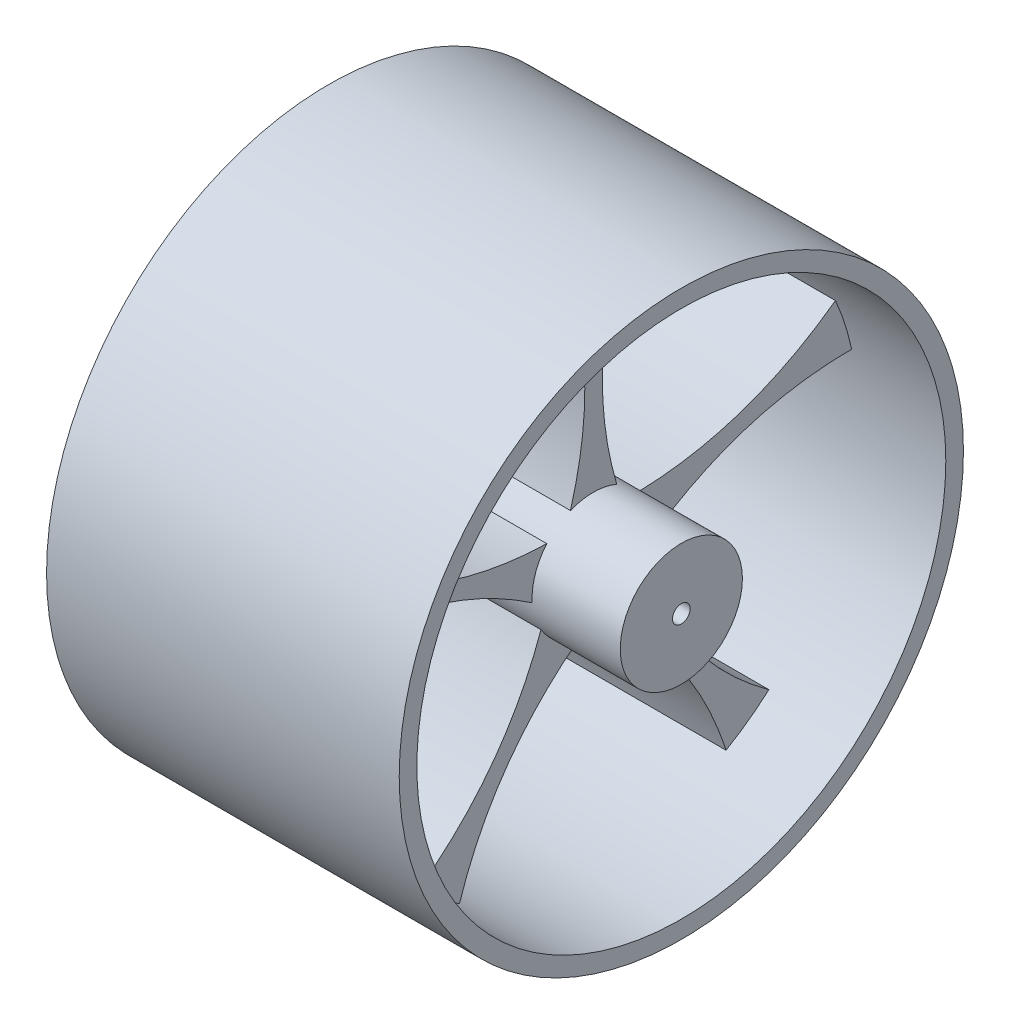
ISO-10303-21;
HEADER;
FILE_DESCRIPTION(('STEP AP214'),'2;1');
FILE_NAME('part.step','',(''),(''),'','','');
FILE_SCHEMA(('AUTOMOTIVE_DESIGN { 1 0 10303 214 1 1 1 1 }'));
ENDSEC;
DATA;
#1=APPLICATION_CONTEXT('core data for automotive mechanical design processes');
#2=APPLICATION_PROTOCOL_DEFINITION('international standard','automotive_design',2000,#1);
#3=PRODUCT_CONTEXT('',#1,'mechanical');
#4=PRODUCT('Part','Part','',(#3));
#5=PRODUCT_RELATED_PRODUCT_CATEGORY('part','',(#4));
#6=PRODUCT_DEFINITION_FORMATION('','',#4);
#7=PRODUCT_DEFINITION_CONTEXT('part definition',#1,'design');
#8=PRODUCT_DEFINITION('design','',#6,#7);
#9=PRODUCT_DEFINITION_SHAPE('','',#8);
#10=(LENGTH_UNIT() NAMED_UNIT(*) SI_UNIT(.MILLI.,.METRE.));
#11=(NAMED_UNIT(*) PLANE_ANGLE_UNIT() SI_UNIT($,.RADIAN.));
#12=(NAMED_UNIT(*) SI_UNIT($,.STERADIAN.) SOLID_ANGLE_UNIT());
#13=UNCERTAINTY_MEASURE_WITH_UNIT(LENGTH_MEASURE(1.E-05),#10,'distance_accuracy_value','');
#14=(GEOMETRIC_REPRESENTATION_CONTEXT(3) GLOBAL_UNCERTAINTY_ASSIGNED_CONTEXT((#13)) GLOBAL_UNIT_ASSIGNED_CONTEXT((#10,
#11,#12)) REPRESENTATION_CONTEXT('',''));
#15=CARTESIAN_POINT('',(0.,0.,0.));
#16=DIRECTION('',(0.,0.,1.));
#17=DIRECTION('',(1.,0.,0.));
#18=AXIS2_PLACEMENT_3D('',#15,#16,#17);
#19=CARTESIAN_POINT('',(100.,0.,0.));
#20=DIRECTION('',(-1.,0.,0.));
#21=DIRECTION('',(0.,0.,1.));
#22=AXIS2_PLACEMENT_3D('',#19,#20,#21);
#23=CYLINDRICAL_SURFACE('',#22,75.);
#24=CARTESIAN_POINT('',(100.,0.,0.));
#25=DIRECTION('',(1.,0.,0.));
#26=DIRECTION('',(0.,0.,-1.));
#27=AXIS2_PLACEMENT_3D('',#24,#25,#26);
#28=CIRCLE('',#27,75.);
#29=CARTESIAN_POINT('',(100.,0.,-75.));
#30=VERTEX_POINT('',#29);
#31=EDGE_CURVE('E131',#30,#30,#28,.T.);
#32=ORIENTED_EDGE('',*,*,#31,.T.);
#33=EDGE_LOOP('',(#32));
#34=FACE_BOUND('',#33,.T.);
#35=CARTESIAN_POINT('',(0.,0.,0.));
#36=DIRECTION('',(1.,0.,0.));
#37=DIRECTION('',(0.,0.,-1.));
#38=AXIS2_PLACEMENT_3D('',#35,#36,#37);
#39=CIRCLE('',#38,75.);
#40=CARTESIAN_POINT('',(0.,0.,-75.));
#41=VERTEX_POINT('',#40);
#42=EDGE_CURVE('E540',#41,#41,#39,.T.);
#43=ORIENTED_EDGE('',*,*,#42,.F.);
#44=EDGE_LOOP('',(#43));
#45=FACE_BOUND('',#44,.T.);
#46=DIRECTION('',(-1.,0.,0.));
#47=VECTOR('',#46,1.);
#48=CARTESIAN_POINT('',(75.,74.637146017459,7.36861142743376));
#49=LINE('',#48,#47);
#50=CARTESIAN_POINT('',(75.,74.637146017459,7.36861142743376));
#51=VERTEX_POINT('',#50);
#52=CARTESIAN_POINT('',(25.,74.637146017459,7.36861142743376));
#53=VERTEX_POINT('',#52);
#54=EDGE_CURVE('E543',#51,#53,#49,.T.);
#55=ORIENTED_EDGE('',*,*,#54,.F.);
#56=CARTESIAN_POINT('',(75.,0.,0.));
#57=DIRECTION('',(-1.,0.,0.));
#58=DIRECTION('',(0.,0.,1.));
#59=AXIS2_PLACEMENT_3D('',#56,#57,#58);
#60=CIRCLE('',#59,75.);
#61=CARTESIAN_POINT('',(75.,74.6108517160549,-7.63025597243463));
#62=VERTEX_POINT('',#61);
#63=EDGE_CURVE('E499',#51,#62,#60,.T.);
#64=ORIENTED_EDGE('',*,*,#63,.T.);
#65=DIRECTION('',(-1.,0.,0.));
#66=VECTOR('',#65,1.);
#67=CARTESIAN_POINT('',(75.,74.6108517160549,-7.63025597243463));
#68=LINE('',#67,#66);
#69=CARTESIAN_POINT('',(25.,74.6108517160549,-7.63025597243463));
#70=VERTEX_POINT('',#69);
#71=EDGE_CURVE('E807',#62,#70,#68,.T.);
#72=ORIENTED_EDGE('',*,*,#71,.T.);
#73=CARTESIAN_POINT('',(25.,0.,0.));
#74=DIRECTION('',(-1.,0.,0.));
#75=DIRECTION('',(0.,0.,1.));
#76=AXIS2_PLACEMENT_3D('',#73,#74,#75);
#77=CIRCLE('',#76,75.);
#78=EDGE_CURVE('E812',#53,#70,#77,.T.);
#79=ORIENTED_EDGE('',*,*,#78,.F.);
#80=EDGE_LOOP('',(#55,#64,#72,#79));
#81=FACE_BOUND('',#80,.T.);
#82=DIRECTION('',(-1.,0.,0.));
#83=VECTOR('',#82,1.);
#84=CARTESIAN_POINT('',(75.,30.0721124451469,-68.7071179215549));
#85=LINE('',#84,#83);
#86=CARTESIAN_POINT('',(75.,30.0721124451469,-68.7071179215549));
#87=VERTEX_POINT('',#86);
#88=CARTESIAN_POINT('',(25.,30.0721124451469,-68.7071179215549));
#89=VERTEX_POINT('',#88);
#90=EDGE_CURVE('E464',#87,#89,#85,.T.);
#91=ORIENTED_EDGE('',*,*,#90,.F.);
#92=CARTESIAN_POINT('',(75.,0.,0.));
#93=DIRECTION('',(-1.,0.,0.));
#94=DIRECTION('',(0.,0.951056516295155,0.309016994374945));
#95=AXIS2_PLACEMENT_3D('',#92,#93,#94);
#96=CIRCLE('',#95,75.);
#97=CARTESIAN_POINT('',(75.,15.799216481466,-73.3170154777987));
#98=VERTEX_POINT('',#97);
#99=EDGE_CURVE('E425',#87,#98,#96,.T.);
#100=ORIENTED_EDGE('',*,*,#99,.T.);
#101=DIRECTION('',(-1.,0.,0.));
#102=VECTOR('',#101,1.);
#103=CARTESIAN_POINT('',(75.,15.799216481466,-73.3170154777987));
#104=LINE('',#103,#102);
#105=CARTESIAN_POINT('',(25.,15.799216481466,-73.3170154777987));
#106=VERTEX_POINT('',#105);
#107=EDGE_CURVE('E461',#98,#106,#104,.T.);
#108=ORIENTED_EDGE('',*,*,#107,.T.);
#109=CARTESIAN_POINT('',(25.,0.,0.));
#110=DIRECTION('',(-1.,0.,0.));
#111=DIRECTION('',(0.,0.951056516295155,0.309016994374945));
#112=AXIS2_PLACEMENT_3D('',#109,#110,#111);
#113=CIRCLE('',#112,75.);
#114=EDGE_CURVE('E440',#89,#106,#113,.T.);
#115=ORIENTED_EDGE('',*,*,#114,.F.);
#116=EDGE_LOOP('',(#91,#100,#108,#115));
#117=FACE_BOUND('',#116,.T.);
#118=DIRECTION('',(-1.,0.,0.));
#119=VECTOR('',#118,1.);
#120=CARTESIAN_POINT('',(75.,-56.0515584128497,-49.8319455720013));
#121=LINE('',#120,#119);
#122=CARTESIAN_POINT('',(75.,-56.0515584128497,-49.8319455720013));
#123=VERTEX_POINT('',#122);
#124=CARTESIAN_POINT('',(25.,-56.0515584128497,-49.8319455720013));
#125=VERTEX_POINT('',#124);
#126=EDGE_CURVE('E549',#123,#125,#121,.T.);
#127=ORIENTED_EDGE('',*,*,#126,.F.);
#128=CARTESIAN_POINT('',(75.,0.,0.));
#129=DIRECTION('',(-1.,0.,0.));
#130=DIRECTION('',(0.,0.587785252292469,-0.809016994374951));
#131=AXIS2_PLACEMENT_3D('',#128,#129,#130);
#132=CIRCLE('',#131,75.);
#133=CARTESIAN_POINT('',(75.,-64.8463989348915,-37.6821515465467));
#134=VERTEX_POINT('',#133);
#135=EDGE_CURVE('E385',#123,#134,#132,.T.);
#136=ORIENTED_EDGE('',*,*,#135,.T.);
#137=DIRECTION('',(-1.,0.,0.));
#138=VECTOR('',#137,1.);
#139=CARTESIAN_POINT('',(75.,-64.8463989348915,-37.6821515465467));
#140=LINE('',#139,#138);
#141=CARTESIAN_POINT('',(25.,-64.8463989348915,-37.6821515465467));
#142=VERTEX_POINT('',#141);
#143=EDGE_CURVE('E870',#134,#142,#140,.T.);
#144=ORIENTED_EDGE('',*,*,#143,.T.);
#145=CARTESIAN_POINT('',(25.,0.,0.));
#146=DIRECTION('',(-1.,0.,0.));
#147=DIRECTION('',(0.,0.587785252292469,-0.809016994374951));
#148=AXIS2_PLACEMENT_3D('',#145,#146,#147);
#149=CIRCLE('',#148,75.);
#150=EDGE_CURVE('E886',#125,#142,#149,.T.);
#151=ORIENTED_EDGE('',*,*,#150,.F.);
#152=EDGE_LOOP('',(#127,#136,#144,#151));
#153=FACE_BOUND('',#152,.T.);
#154=DIRECTION('',(-1.,0.,0.));
#155=VECTOR('',#154,1.);
#156=CARTESIAN_POINT('',(75.,-64.7138806666878,37.9092818325235));
#157=LINE('',#156,#155);
#158=CARTESIAN_POINT('',(75.,-64.7138806666878,37.9092818325235));
#159=VERTEX_POINT('',#158);
#160=CARTESIAN_POINT('',(25.,-64.7138806666878,37.9092818325235));
#161=VERTEX_POINT('',#160);
#162=EDGE_CURVE('E366',#159,#161,#157,.T.);
#163=ORIENTED_EDGE('',*,*,#162,.F.);
#164=CARTESIAN_POINT('',(75.,0.,0.));
#165=DIRECTION('',(-1.,0.,0.));
#166=DIRECTION('',(0.,-0.58778525229248,-0.809016994374942));
#167=AXIS2_PLACEMENT_3D('',#164,#165,#166);
#168=CIRCLE('',#167,75.);
#169=CARTESIAN_POINT('',(75.,-55.8764950712635,50.0281650528087));
#170=VERTEX_POINT('',#169);
#171=EDGE_CURVE('E328',#159,#170,#168,.T.);
#172=ORIENTED_EDGE('',*,*,#171,.T.);
#173=DIRECTION('',(-1.,0.,0.));
#174=VECTOR('',#173,1.);
#175=CARTESIAN_POINT('',(75.,-55.8764950712635,50.0281650528087));
#176=LINE('',#175,#174);
#177=CARTESIAN_POINT('',(25.,-55.8764950712635,50.0281650528087));
#178=VERTEX_POINT('',#177);
#179=EDGE_CURVE('E363',#170,#178,#176,.T.);
#180=ORIENTED_EDGE('',*,*,#179,.T.);
#181=CARTESIAN_POINT('',(25.,0.,0.));
#182=DIRECTION('',(-1.,0.,0.));
#183=DIRECTION('',(0.,-0.58778525229248,-0.809016994374942));
#184=AXIS2_PLACEMENT_3D('',#181,#182,#183);
#185=CIRCLE('',#184,75.);
#186=EDGE_CURVE('E342',#161,#178,#185,.T.);
#187=ORIENTED_EDGE('',*,*,#186,.F.);
#188=EDGE_LOOP('',(#163,#172,#180,#187));
#189=FACE_BOUND('',#188,.T.);
#190=DIRECTION('',(-1.,0.,0.));
#191=VECTOR('',#190,1.);
#192=CARTESIAN_POINT('',(75.,16.0561806169323,73.2611702335995));
#193=LINE('',#192,#191);
#194=CARTESIAN_POINT('',(75.,16.0561806169323,73.2611702335995));
#195=VERTEX_POINT('',#194);
#196=CARTESIAN_POINT('',(25.,16.0561806169323,73.2611702335995));
#197=VERTEX_POINT('',#196);
#198=EDGE_CURVE('E144',#195,#197,#193,.T.);
#199=ORIENTED_EDGE('',*,*,#198,.F.);
#200=CARTESIAN_POINT('',(75.,0.,0.));
#201=DIRECTION('',(-1.,0.,0.));
#202=DIRECTION('',(0.,-0.95105651629515,0.309016994374958));
#203=AXIS2_PLACEMENT_3D('',#200,#201,#202);
#204=CIRCLE('',#203,75.);
#205=CARTESIAN_POINT('',(75.,30.3128258086349,68.6012579439719));
#206=VERTEX_POINT('',#205);
#207=EDGE_CURVE('E139',#195,#206,#204,.T.);
#208=ORIENTED_EDGE('',*,*,#207,.T.);
#209=DIRECTION('',(-1.,0.,0.));
#210=VECTOR('',#209,1.);
#211=CARTESIAN_POINT('',(75.,30.3128258086349,68.6012579439719));
#212=LINE('',#211,#210);
#213=CARTESIAN_POINT('',(25.,30.3128258086349,68.6012579439719));
#214=VERTEX_POINT('',#213);
#215=EDGE_CURVE('E573',#206,#214,#212,.T.);
#216=ORIENTED_EDGE('',*,*,#215,.T.);
#217=CARTESIAN_POINT('',(25.,0.,0.));
#218=DIRECTION('',(-1.,0.,0.));
#219=DIRECTION('',(0.,-0.95105651629515,0.309016994374958));
#220=AXIS2_PLACEMENT_3D('',#217,#218,#219);
#221=CIRCLE('',#220,75.);
#222=EDGE_CURVE('E286',#197,#214,#221,.T.);
#223=ORIENTED_EDGE('',*,*,#222,.F.);
#224=EDGE_LOOP('',(#199,#208,#216,#223));
#225=FACE_BOUND('',#224,.T.);
#226=ADVANCED_FACE('F122',(#34,#45,#81,#117,#153,#189,#225),#23,.F.);
#227=CARTESIAN_POINT('',(100.,0.,0.));
#228=DIRECTION('',(-1.,0.,0.));
#229=DIRECTION('',(0.,0.,1.));
#230=AXIS2_PLACEMENT_3D('',#227,#228,#229);
#231=CYLINDRICAL_SURFACE('',#230,17.3205080756888);
#232=CARTESIAN_POINT('',(75.,0.,0.));
#233=DIRECTION('',(-1.,0.,0.));
#234=DIRECTION('',(0.,-0.58778525229248,-0.809016994374942));
#235=AXIS2_PLACEMENT_3D('',#232,#233,#234);
#236=CIRCLE('',#235,17.3205080756888);
#237=CARTESIAN_POINT('',(75.,-16.7934103177765,4.24044454023355));
#238=VERTEX_POINT('',#237);
#239=CARTESIAN_POINT('',(75.,-8.99927078121396,14.7990920466895));
#240=VERTEX_POINT('',#239);
#241=EDGE_CURVE('E355',#238,#240,#236,.T.);
#242=ORIENTED_EDGE('',*,*,#241,.F.);
#243=DIRECTION('',(-1.,0.,0.));
#244=VECTOR('',#243,1.);
#245=CARTESIAN_POINT('',(75.,-16.7934103177765,4.24044454023355));
#246=LINE('',#245,#244);
#247=CARTESIAN_POINT('',(25.,-16.7934103177765,4.24044454023355));
#248=VERTEX_POINT('',#247);
#249=EDGE_CURVE('E327',#238,#248,#246,.T.);
#250=ORIENTED_EDGE('',*,*,#249,.T.);
#251=CARTESIAN_POINT('',(25.,0.,0.));
#252=DIRECTION('',(-1.,0.,0.));
#253=DIRECTION('',(0.,-0.58778525229248,-0.809016994374942));
#254=AXIS2_PLACEMENT_3D('',#251,#252,#253);
#255=CIRCLE('',#254,17.3205080756888);
#256=CARTESIAN_POINT('',(25.,-8.99927078121396,14.7990920466895));
#257=VERTEX_POINT('',#256);
#258=EDGE_CURVE('E329',#248,#257,#255,.T.);
#259=ORIENTED_EDGE('',*,*,#258,.T.);
#260=DIRECTION('',(-1.,0.,0.));
#261=VECTOR('',#260,1.);
#262=CARTESIAN_POINT('',(75.,-8.99927078121396,14.7990920466895));
#263=LINE('',#262,#261);
#264=EDGE_CURVE('E356',#240,#257,#263,.T.);
#265=ORIENTED_EDGE('',*,*,#264,.F.);
#266=EDGE_LOOP('',(#242,#250,#259,#265));
#267=FACE_BOUND('',#266,.T.);
#268=CARTESIAN_POINT('',(75.,0.,0.));
#269=DIRECTION('',(-1.,0.,0.));
#270=DIRECTION('',(0.,0.951056516295155,0.309016994374945));
#271=AXIS2_PLACEMENT_3D('',#268,#269,#270);
#272=CIRCLE('',#271,17.3205080756888);
#273=CARTESIAN_POINT('',(75.,11.0936835766795,-13.3015106172386));
#274=VERTEX_POINT('',#273);
#275=CARTESIAN_POINT('',(75.,-1.41812505337883,-17.2623556136751));
#276=VERTEX_POINT('',#275);
#277=EDGE_CURVE('E453',#274,#276,#272,.T.);
#278=ORIENTED_EDGE('',*,*,#277,.F.);
#279=DIRECTION('',(-1.,0.,0.));
#280=VECTOR('',#279,1.);
#281=CARTESIAN_POINT('',(75.,11.0936835766795,-13.3015106172386));
#282=LINE('',#281,#280);
#283=CARTESIAN_POINT('',(25.,11.0936835766795,-13.3015106172386));
#284=VERTEX_POINT('',#283);
#285=EDGE_CURVE('E424',#274,#284,#282,.T.);
#286=ORIENTED_EDGE('',*,*,#285,.T.);
#287=CARTESIAN_POINT('',(25.,0.,0.));
#288=DIRECTION('',(-1.,0.,0.));
#289=DIRECTION('',(0.,0.951056516295155,0.309016994374945));
#290=AXIS2_PLACEMENT_3D('',#287,#288,#289);
#291=CIRCLE('',#290,17.3205080756888);
#292=CARTESIAN_POINT('',(25.,-1.41812505337883,-17.2623556136751));
#293=VERTEX_POINT('',#292);
#294=EDGE_CURVE('E426',#284,#293,#291,.T.);
#295=ORIENTED_EDGE('',*,*,#294,.T.);
#296=DIRECTION('',(-1.,0.,0.));
#297=VECTOR('',#296,1.);
#298=CARTESIAN_POINT('',(75.,-1.41812505337883,-17.2623556136751));
#299=LINE('',#298,#297);
#300=EDGE_CURVE('E454',#276,#293,#299,.T.);
#301=ORIENTED_EDGE('',*,*,#300,.F.);
#302=EDGE_LOOP('',(#278,#286,#295,#301));
#303=FACE_BOUND('',#302,.T.);
#304=CARTESIAN_POINT('',(0.,0.,0.));
#305=DIRECTION('',(1.,0.,0.));
#306=DIRECTION('',(0.,0.,-1.));
#307=AXIS2_PLACEMENT_3D('',#304,#305,#306);
#308=CIRCLE('',#307,17.3205080756888);
#309=CARTESIAN_POINT('',(0.,0.,-17.3205080756888));
#310=VERTEX_POINT('',#309);
#311=EDGE_CURVE('E479',#310,#310,#308,.T.);
#312=ORIENTED_EDGE('',*,*,#311,.T.);
#313=EDGE_LOOP('',(#312));
#314=FACE_BOUND('',#313,.T.);
#315=CARTESIAN_POINT('',(100.,0.,0.));
#316=DIRECTION('',(1.,0.,0.));
#317=DIRECTION('',(0.,0.,-1.));
#318=AXIS2_PLACEMENT_3D('',#315,#316,#317);
#319=CIRCLE('',#318,17.3205080756888);
#320=CARTESIAN_POINT('',(100.,0.,-17.3205080756888));
#321=VERTEX_POINT('',#320);
#322=EDGE_CURVE('E475',#321,#321,#319,.T.);
#323=ORIENTED_EDGE('',*,*,#322,.F.);
#324=EDGE_LOOP('',(#323));
#325=FACE_BOUND('',#324,.T.);
#326=DIRECTION('',(-1.,0.,0.));
#327=VECTOR('',#326,1.);
#328=CARTESIAN_POINT('',(75.,15.979251051347,-6.68307832050667));
#329=LINE('',#328,#327);
#330=CARTESIAN_POINT('',(75.,15.979251051347,-6.68307832050667));
#331=VERTEX_POINT('',#330);
#332=CARTESIAN_POINT('',(25.,15.979251051347,-6.68307832050667));
#333=VERTEX_POINT('',#332);
#334=EDGE_CURVE('E809',#331,#333,#329,.T.);
#335=ORIENTED_EDGE('',*,*,#334,.F.);
#336=CARTESIAN_POINT('',(75.,0.,0.));
#337=DIRECTION('',(-1.,0.,0.));
#338=DIRECTION('',(0.,0.,1.));
#339=AXIS2_PLACEMENT_3D('',#336,#337,#338);
#340=CIRCLE('',#339,17.3205080756888);
#341=CARTESIAN_POINT('',(75.,16.0786251045062,6.44032722373205));
#342=VERTEX_POINT('',#341);
#343=EDGE_CURVE('E487',#342,#331,#340,.T.);
#344=ORIENTED_EDGE('',*,*,#343,.F.);
#345=DIRECTION('',(-1.,0.,0.));
#346=VECTOR('',#345,1.);
#347=CARTESIAN_POINT('',(75.,16.0786251045062,6.44032722373205));
#348=LINE('',#347,#346);
#349=CARTESIAN_POINT('',(25.,16.0786251045062,6.44032722373205));
#350=VERTEX_POINT('',#349);
#351=EDGE_CURVE('E836',#342,#350,#348,.T.);
#352=ORIENTED_EDGE('',*,*,#351,.T.);
#353=CARTESIAN_POINT('',(25.,0.,0.));
#354=DIRECTION('',(-1.,0.,0.));
#355=DIRECTION('',(0.,0.,1.));
#356=AXIS2_PLACEMENT_3D('',#353,#354,#355);
#357=CIRCLE('',#356,17.3205080756888);
#358=EDGE_CURVE('E483',#350,#333,#357,.T.);
#359=ORIENTED_EDGE('',*,*,#358,.T.);
#360=EDGE_LOOP('',(#335,#344,#352,#359));
#361=FACE_BOUND('',#360,.T.);
#362=CARTESIAN_POINT('',(75.,0.,0.));
#363=DIRECTION('',(-1.,0.,0.));
#364=DIRECTION('',(0.,0.587785252292469,-0.809016994374951));
#365=AXIS2_PLACEMENT_3D('',#362,#363,#364);
#366=CIRCLE('',#365,17.3205080756888);
#367=CARTESIAN_POINT('',(75.,-9.22235159368181,-14.6611128869031));
#368=VERTEX_POINT('',#367);
#369=CARTESIAN_POINT('',(75.,-16.8557005346329,-3.98564417463198));
#370=VERTEX_POINT('',#369);
#371=EDGE_CURVE('E373',#368,#370,#366,.T.);
#372=ORIENTED_EDGE('',*,*,#371,.F.);
#373=DIRECTION('',(-1.,0.,0.));
#374=VECTOR('',#373,1.);
#375=CARTESIAN_POINT('',(75.,-9.22235159368181,-14.6611128869031));
#376=LINE('',#375,#374);
#377=CARTESIAN_POINT('',(25.,-9.22235159368181,-14.6611128869031));
#378=VERTEX_POINT('',#377);
#379=EDGE_CURVE('E875',#368,#378,#376,.T.);
#380=ORIENTED_EDGE('',*,*,#379,.T.);
#381=CARTESIAN_POINT('',(25.,0.,0.));
#382=DIRECTION('',(-1.,0.,0.));
#383=DIRECTION('',(0.,0.587785252292469,-0.809016994374951));
#384=AXIS2_PLACEMENT_3D('',#381,#382,#383);
#385=CIRCLE('',#384,17.3205080756888);
#386=CARTESIAN_POINT('',(25.,-16.8557005346329,-3.98564417463198));
#387=VERTEX_POINT('',#386);
#388=EDGE_CURVE('E362',#378,#387,#385,.T.);
#389=ORIENTED_EDGE('',*,*,#388,.T.);
#390=DIRECTION('',(-1.,0.,0.));
#391=VECTOR('',#390,1.);
#392=CARTESIAN_POINT('',(75.,-16.8557005346329,-3.98564417463198));
#393=LINE('',#392,#391);
#394=EDGE_CURVE('E434',#370,#387,#393,.T.);
#395=ORIENTED_EDGE('',*,*,#394,.F.);
#396=EDGE_LOOP('',(#372,#380,#389,#395));
#397=FACE_BOUND('',#396,.T.);
#398=CARTESIAN_POINT('',(75.,0.,0.));
#399=DIRECTION('',(-1.,0.,0.));
#400=DIRECTION('',(0.,-0.95105651629515,0.309016994374958));
#401=AXIS2_PLACEMENT_3D('',#398,#399,#400);
#402=CIRCLE('',#401,17.3205080756888);
#403=CARTESIAN_POINT('',(75.,-1.15654676972717,17.2818517401763));
#404=VERTEX_POINT('',#403);
#405=CARTESIAN_POINT('',(75.,11.2938453178789,13.1319860621243));
#406=VERTEX_POINT('',#405);
#407=EDGE_CURVE('E275',#404,#406,#402,.T.);
#408=ORIENTED_EDGE('',*,*,#407,.F.);
#409=DIRECTION('',(-1.,0.,0.));
#410=VECTOR('',#409,1.);
#411=CARTESIAN_POINT('',(75.,-1.15654676972717,17.2818517401763));
#412=LINE('',#411,#410);
#413=CARTESIAN_POINT('',(25.,-1.15654676972717,17.2818517401763));
#414=VERTEX_POINT('',#413);
#415=EDGE_CURVE('E260',#404,#414,#412,.T.);
#416=ORIENTED_EDGE('',*,*,#415,.T.);
#417=CARTESIAN_POINT('',(25.,0.,0.));
#418=DIRECTION('',(-1.,0.,0.));
#419=DIRECTION('',(0.,-0.95105651629515,0.309016994374958));
#420=AXIS2_PLACEMENT_3D('',#417,#418,#419);
#421=CIRCLE('',#420,17.3205080756888);
#422=CARTESIAN_POINT('',(25.,11.2938453178789,13.1319860621243));
#423=VERTEX_POINT('',#422);
#424=EDGE_CURVE('E590',#414,#423,#421,.T.);
#425=ORIENTED_EDGE('',*,*,#424,.T.);
#426=DIRECTION('',(-1.,0.,0.));
#427=VECTOR('',#426,1.);
#428=CARTESIAN_POINT('',(75.,11.2938453178789,13.1319860621243));
#429=LINE('',#428,#427);
#430=EDGE_CURVE('E280',#406,#423,#429,.T.);
#431=ORIENTED_EDGE('',*,*,#430,.F.);
#432=EDGE_LOOP('',(#408,#416,#425,#431));
#433=FACE_BOUND('',#432,.T.);
#434=ADVANCED_FACE('F279',(#267,#303,#314,#325,#361,#397,#433),#231,.T.);
#435=CARTESIAN_POINT('',(100.,0.,0.));
#436=DIRECTION('',(-1.,0.,0.));
#437=DIRECTION('',(0.,0.,1.));
#438=AXIS2_PLACEMENT_3D('',#435,#436,#437);
#439=CYLINDRICAL_SURFACE('',#438,80.);
#440=CARTESIAN_POINT('',(100.,0.,0.));
#441=DIRECTION('',(1.,0.,0.));
#442=DIRECTION('',(0.,0.,-1.));
#443=AXIS2_PLACEMENT_3D('',#440,#441,#442);
#444=CIRCLE('',#443,80.);
#445=CARTESIAN_POINT('',(100.,0.,-80.));
#446=VERTEX_POINT('',#445);
#447=EDGE_CURVE('E12',#446,#446,#444,.T.);
#448=ORIENTED_EDGE('',*,*,#447,.F.);
#449=EDGE_LOOP('',(#448));
#450=FACE_BOUND('',#449,.T.);
#451=CARTESIAN_POINT('',(0.,0.,0.));
#452=DIRECTION('',(1.,0.,0.));
#453=DIRECTION('',(0.,0.,-1.));
#454=AXIS2_PLACEMENT_3D('',#451,#452,#453);
#455=CIRCLE('',#454,80.);
#456=CARTESIAN_POINT('',(0.,0.,-80.));
#457=VERTEX_POINT('',#456);
#458=EDGE_CURVE('E125',#457,#457,#455,.T.);
#459=ORIENTED_EDGE('',*,*,#458,.T.);
#460=EDGE_LOOP('',(#459));
#461=FACE_BOUND('',#460,.T.);
#462=ADVANCED_FACE('F517',(#450,#461),#439,.T.);
#463=CARTESIAN_POINT('',(100.,0.,0.));
#464=DIRECTION('',(1.,0.,0.));
#465=DIRECTION('',(0.,0.,-1.));
#466=AXIS2_PLACEMENT_3D('',#463,#464,#465);
#467=PLANE('',#466);
#468=ORIENTED_EDGE('',*,*,#31,.F.);
#469=EDGE_LOOP('',(#468));
#470=FACE_BOUND('',#469,.T.);
#471=ORIENTED_EDGE('',*,*,#447,.T.);
#472=EDGE_LOOP('',(#471));
#473=FACE_BOUND('',#472,.T.);
#474=ADVANCED_FACE('F513',(#470,#473),#467,.T.);
#475=CARTESIAN_POINT('',(0.,0.,0.));
#476=DIRECTION('',(1.,0.,0.));
#477=DIRECTION('',(0.,0.,-1.));
#478=AXIS2_PLACEMENT_3D('',#475,#476,#477);
#479=PLANE('',#478);
#480=ORIENTED_EDGE('',*,*,#42,.T.);
#481=EDGE_LOOP('',(#480));
#482=FACE_BOUND('',#481,.T.);
#483=ORIENTED_EDGE('',*,*,#458,.F.);
#484=EDGE_LOOP('',(#483));
#485=FACE_BOUND('',#484,.T.);
#486=ADVANCED_FACE('F516',(#482,#485),#479,.F.);
#487=CARTESIAN_POINT('',(75.,12.9138699220361,-7.63025597243464));
#488=CARTESIAN_POINT('',(75.,43.84791667095,2.4250815360805));
#489=CARTESIAN_POINT('',(75.,74.6108517160549,-7.63025597243463));
#490=B_SPLINE_CURVE_WITH_KNOTS('',2,(#487,#488,#489),.UNSPECIFIED.,.F.,.F.,(3,3),(0.,1.),.UNSPECIFIED.);
#491=DIRECTION('',(-1.,0.,0.));
#492=VECTOR('',#491,1.);
#493=SURFACE_OF_LINEAR_EXTRUSION('',#490,#492);
#494=CARTESIAN_POINT('',(25.,12.9138699220361,-7.63025597243464));
#495=CARTESIAN_POINT('',(25.,43.84791667095,2.4250815360805));
#496=CARTESIAN_POINT('',(25.,74.6108517160549,-7.63025597243463));
#497=B_SPLINE_CURVE_WITH_KNOTS('',2,(#494,#495,#496),.UNSPECIFIED.,.F.,.F.,(3,3),(0.,1.),.UNSPECIFIED.);
#498=EDGE_CURVE('E492',#333,#70,#497,.T.);
#499=ORIENTED_EDGE('',*,*,#498,.T.);
#500=ORIENTED_EDGE('',*,*,#71,.F.);
#501=EDGE_CURVE('E840',#331,#62,#490,.T.);
#502=ORIENTED_EDGE('',*,*,#501,.F.);
#503=ORIENTED_EDGE('',*,*,#334,.T.);
#504=EDGE_LOOP('',(#499,#500,#502,#503));
#505=FACE_BOUND('',#504,.T.);
#506=ADVANCED_FACE('F510',(#505),#493,.F.);
#507=CARTESIAN_POINT('',(75.,13.0649304705244,7.36861142743376));
#508=CARTESIAN_POINT('',(75.,43.9313645038625,-2.6256876770304));
#509=CARTESIAN_POINT('',(75.,74.637146017459,7.36861142743376));
#510=B_SPLINE_CURVE_WITH_KNOTS('',2,(#507,#508,#509),.UNSPECIFIED.,.F.,.F.,(3,3),(0.,1.),.UNSPECIFIED.);
#511=DIRECTION('',(-1.,0.,0.));
#512=VECTOR('',#511,1.);
#513=SURFACE_OF_LINEAR_EXTRUSION('',#510,#512);
#514=CARTESIAN_POINT('',(25.,13.0649304705244,7.36861142743376));
#515=CARTESIAN_POINT('',(25.,43.9313645038625,-2.6256876770304));
#516=CARTESIAN_POINT('',(25.,74.637146017459,7.36861142743376));
#517=B_SPLINE_CURVE_WITH_KNOTS('',2,(#514,#515,#516),.UNSPECIFIED.,.F.,.F.,(3,3),(0.,1.),.UNSPECIFIED.);
#518=EDGE_CURVE('E816',#350,#53,#517,.T.);
#519=ORIENTED_EDGE('',*,*,#518,.F.);
#520=ORIENTED_EDGE('',*,*,#351,.F.);
#521=EDGE_CURVE('E491',#342,#51,#510,.T.);
#522=ORIENTED_EDGE('',*,*,#521,.T.);
#523=ORIENTED_EDGE('',*,*,#54,.T.);
#524=EDGE_LOOP('',(#519,#520,#522,#523));
#525=FACE_BOUND('',#524,.T.);
#526=ADVANCED_FACE('F505',(#525),#513,.T.);
#527=CARTESIAN_POINT('',(75.,0.,0.));
#528=DIRECTION('',(-1.,0.,0.));
#529=DIRECTION('',(0.,0.,1.));
#530=AXIS2_PLACEMENT_3D('',#527,#528,#529);
#531=PLANE('',#530);
#532=ORIENTED_EDGE('',*,*,#343,.T.);
#533=ORIENTED_EDGE('',*,*,#501,.T.);
#534=ORIENTED_EDGE('',*,*,#63,.F.);
#535=ORIENTED_EDGE('',*,*,#521,.F.);
#536=EDGE_LOOP('',(#532,#533,#534,#535));
#537=FACE_BOUND('',#536,.T.);
#538=ADVANCED_FACE('F509',(#537),#531,.F.);
#539=CARTESIAN_POINT('',(25.,0.,0.));
#540=DIRECTION('',(-1.,0.,0.));
#541=DIRECTION('',(0.,0.,1.));
#542=AXIS2_PLACEMENT_3D('',#539,#540,#541);
#543=PLANE('',#542);
#544=ORIENTED_EDGE('',*,*,#358,.F.);
#545=ORIENTED_EDGE('',*,*,#518,.T.);
#546=ORIENTED_EDGE('',*,*,#78,.T.);
#547=ORIENTED_EDGE('',*,*,#498,.F.);
#548=EDGE_LOOP('',(#544,#545,#546,#547));
#549=FACE_BOUND('',#548,.T.);
#550=ADVANCED_FACE('F698',(#549),#543,.T.);
#551=CARTESIAN_POINT('',(0.,0.,0.));
#552=DIRECTION('',(1.,0.,0.));
#553=DIRECTION('',(0.,0.,-1.));
#554=AXIS2_PLACEMENT_3D('',#551,#552,#553);
#555=PLANE('',#554);
#556=CARTESIAN_POINT('',(0.,0.,0.));
#557=DIRECTION('',(-1.,0.,0.));
#558=DIRECTION('',(0.,0.,1.));
#559=AXIS2_PLACEMENT_3D('',#556,#557,#558);
#560=CIRCLE('',#559,2.5);
#561=CARTESIAN_POINT('',(0.,0.,2.5));
#562=VERTEX_POINT('',#561);
#563=EDGE_CURVE('E460',#562,#562,#560,.T.);
#564=ORIENTED_EDGE('',*,*,#563,.F.);
#565=EDGE_LOOP('',(#564));
#566=FACE_BOUND('',#565,.T.);
#567=ORIENTED_EDGE('',*,*,#311,.F.);
#568=EDGE_LOOP('',(#567));
#569=FACE_BOUND('',#568,.T.);
#570=ADVANCED_FACE('F690',(#566,#569),#555,.F.);
#571=CARTESIAN_POINT('',(100.,0.,0.));
#572=DIRECTION('',(1.,0.,0.));
#573=DIRECTION('',(0.,0.,-1.));
#574=AXIS2_PLACEMENT_3D('',#571,#572,#573);
#575=PLANE('',#574);
#576=CARTESIAN_POINT('',(100.,0.,0.));
#577=DIRECTION('',(-1.,0.,0.));
#578=DIRECTION('',(0.,0.,1.));
#579=AXIS2_PLACEMENT_3D('',#576,#577,#578);
#580=CIRCLE('',#579,2.5);
#581=CARTESIAN_POINT('',(100.,0.,2.5));
#582=VERTEX_POINT('',#581);
#583=EDGE_CURVE('E471',#582,#582,#580,.T.);
#584=ORIENTED_EDGE('',*,*,#583,.T.);
#585=EDGE_LOOP('',(#584));
#586=FACE_BOUND('',#585,.T.);
#587=ORIENTED_EDGE('',*,*,#322,.T.);
#588=EDGE_LOOP('',(#587));
#589=FACE_BOUND('',#588,.T.);
#590=ADVANCED_FACE('F688',(#586,#589),#575,.T.);
#591=CARTESIAN_POINT('',(100.,0.,0.));
#592=DIRECTION('',(-1.,0.,0.));
#593=DIRECTION('',(0.,0.,1.));
#594=AXIS2_PLACEMENT_3D('',#591,#592,#593);
#595=CYLINDRICAL_SURFACE('',#594,2.5);
#596=ORIENTED_EDGE('',*,*,#583,.F.);
#597=EDGE_LOOP('',(#596));
#598=FACE_BOUND('',#597,.T.);
#599=ORIENTED_EDGE('',*,*,#563,.T.);
#600=EDGE_LOOP('',(#599));
#601=FACE_BOUND('',#600,.T.);
#602=ADVANCED_FACE('F412',(#598,#601),#595,.F.);
#603=CARTESIAN_POINT('',(75.,-3.26619939452737,-14.6396989068537));
#604=CARTESIAN_POINT('',(75.,15.8561410166964,-40.9524554684801));
#605=CARTESIAN_POINT('',(75.,15.799216481466,-73.3170154777987));
#606=B_SPLINE_CURVE_WITH_KNOTS('',2,(#603,#604,#605),.UNSPECIFIED.,.F.,.F.,(3,3),(0.,1.),.UNSPECIFIED.);
#607=DIRECTION('',(-1.,0.,0.));
#608=VECTOR('',#607,1.);
#609=SURFACE_OF_LINEAR_EXTRUSION('',#606,#608);
#610=CARTESIAN_POINT('',(25.,-3.26619939452737,-14.6396989068537));
#611=CARTESIAN_POINT('',(25.,15.8561410166964,-40.9524554684801));
#612=CARTESIAN_POINT('',(25.,15.799216481466,-73.3170154777987));
#613=B_SPLINE_CURVE_WITH_KNOTS('',2,(#610,#611,#612),.UNSPECIFIED.,.F.,.F.,(3,3),(0.,1.),.UNSPECIFIED.);
#614=EDGE_CURVE('E447',#293,#106,#613,.T.);
#615=ORIENTED_EDGE('',*,*,#614,.T.);
#616=ORIENTED_EDGE('',*,*,#107,.F.);
#617=EDGE_CURVE('E416',#276,#98,#606,.T.);
#618=ORIENTED_EDGE('',*,*,#617,.F.);
#619=ORIENTED_EDGE('',*,*,#300,.T.);
#620=EDGE_LOOP('',(#615,#616,#618,#619));
#621=FACE_BOUND('',#620,.T.);
#622=ADVANCED_FACE('F408',(#621),#609,.F.);
#623=CARTESIAN_POINT('',(75.,11.0452514598269,-10.1484611029129));
#624=CARTESIAN_POINT('',(75.,11.0783608427781,-42.5925925952593));
#625=CARTESIAN_POINT('',(75.,30.0721124451469,-68.7071179215549));
#626=B_SPLINE_CURVE_WITH_KNOTS('',2,(#623,#624,#625),.UNSPECIFIED.,.F.,.F.,(3,3),(0.,1.),.UNSPECIFIED.);
#627=DIRECTION('',(-1.,0.,0.));
#628=VECTOR('',#627,1.);
#629=SURFACE_OF_LINEAR_EXTRUSION('',#626,#628);
#630=CARTESIAN_POINT('',(25.,11.0452514598269,-10.1484611029129));
#631=CARTESIAN_POINT('',(25.,11.0783608427781,-42.5925925952593));
#632=CARTESIAN_POINT('',(25.,30.0721124451469,-68.7071179215549));
#633=B_SPLINE_CURVE_WITH_KNOTS('',2,(#630,#631,#632),.UNSPECIFIED.,.F.,.F.,(3,3),(0.,1.),.UNSPECIFIED.);
#634=EDGE_CURVE('E433',#284,#89,#633,.T.);
#635=ORIENTED_EDGE('',*,*,#634,.F.);
#636=ORIENTED_EDGE('',*,*,#285,.F.);
#637=EDGE_CURVE('E863',#274,#87,#626,.T.);
#638=ORIENTED_EDGE('',*,*,#637,.T.);
#639=ORIENTED_EDGE('',*,*,#90,.T.);
#640=EDGE_LOOP('',(#635,#636,#638,#639));
#641=FACE_BOUND('',#640,.T.);
#642=ADVANCED_FACE('F403',(#641),#629,.T.);
#643=CARTESIAN_POINT('',(75.,0.,0.));
#644=DIRECTION('',(-1.,0.,0.));
#645=DIRECTION('',(0.,0.951056516295155,0.309016994374945));
#646=AXIS2_PLACEMENT_3D('',#643,#644,#645);
#647=PLANE('',#646);
#648=ORIENTED_EDGE('',*,*,#277,.T.);
#649=ORIENTED_EDGE('',*,*,#617,.T.);
#650=ORIENTED_EDGE('',*,*,#99,.F.);
#651=ORIENTED_EDGE('',*,*,#637,.F.);
#652=EDGE_LOOP('',(#648,#649,#650,#651));
#653=FACE_BOUND('',#652,.T.);
#654=ADVANCED_FACE('F399',(#653),#647,.F.);
#655=CARTESIAN_POINT('',(25.,0.,0.));
#656=DIRECTION('',(-1.,0.,0.));
#657=DIRECTION('',(0.,0.951056516295155,0.309016994374945));
#658=AXIS2_PLACEMENT_3D('',#655,#656,#657);
#659=PLANE('',#658);
#660=ORIENTED_EDGE('',*,*,#294,.F.);
#661=ORIENTED_EDGE('',*,*,#634,.T.);
#662=ORIENTED_EDGE('',*,*,#114,.T.);
#663=ORIENTED_EDGE('',*,*,#614,.F.);
#664=EDGE_LOOP('',(#660,#661,#662,#663));
#665=FACE_BOUND('',#664,.T.);
#666=ADVANCED_FACE('F402',(#665),#659,.T.);
#667=CARTESIAN_POINT('',(75.,-14.9324921618884,-1.41757553706555));
#668=CARTESIAN_POINT('',(75.,-34.0482825922204,-27.7350909383675));
#669=CARTESIAN_POINT('',(75.,-64.8463989348915,-37.6821515465467));
#670=B_SPLINE_CURVE_WITH_KNOTS('',2,(#667,#668,#669),.UNSPECIFIED.,.F.,.F.,(3,3),(0.,1.),.UNSPECIFIED.);
#671=DIRECTION('',(-1.,0.,0.));
#672=VECTOR('',#671,1.);
#673=SURFACE_OF_LINEAR_EXTRUSION('',#670,#672);
#674=CARTESIAN_POINT('',(25.,-14.9324921618884,-1.41757553706555));
#675=CARTESIAN_POINT('',(25.,-34.0482825922204,-27.7350909383675));
#676=CARTESIAN_POINT('',(25.,-64.8463989348915,-37.6821515465467));
#677=B_SPLINE_CURVE_WITH_KNOTS('',2,(#674,#675,#676),.UNSPECIFIED.,.F.,.F.,(3,3),(0.,1.),.UNSPECIFIED.);
#678=EDGE_CURVE('E378',#387,#142,#677,.T.);
#679=ORIENTED_EDGE('',*,*,#678,.T.);
#680=ORIENTED_EDGE('',*,*,#143,.F.);
#681=EDGE_CURVE('E879',#370,#134,#670,.T.);
#682=ORIENTED_EDGE('',*,*,#681,.F.);
#683=ORIENTED_EDGE('',*,*,#394,.T.);
#684=EDGE_LOOP('',(#679,#680,#682,#683));
#685=FACE_BOUND('',#684,.T.);
#686=ADVANCED_FACE('F396',(#685),#673,.F.);
#687=CARTESIAN_POINT('',(75.,-6.23858965406204,-13.6407053225401));
#688=CARTESIAN_POINT('',(75.,-37.0845609633898,-23.6979822158167));
#689=CARTESIAN_POINT('',(75.,-56.0515584128497,-49.8319455720013));
#690=B_SPLINE_CURVE_WITH_KNOTS('',2,(#687,#688,#689),.UNSPECIFIED.,.F.,.F.,(3,3),(0.,1.),.UNSPECIFIED.);
#691=DIRECTION('',(-1.,0.,0.));
#692=VECTOR('',#691,1.);
#693=SURFACE_OF_LINEAR_EXTRUSION('',#690,#692);
#694=CARTESIAN_POINT('',(25.,-6.23858965406204,-13.6407053225401));
#695=CARTESIAN_POINT('',(25.,-37.0845609633898,-23.6979822158167));
#696=CARTESIAN_POINT('',(25.,-56.0515584128497,-49.8319455720013));
#697=B_SPLINE_CURVE_WITH_KNOTS('',2,(#694,#695,#696),.UNSPECIFIED.,.F.,.F.,(3,3),(0.,1.),.UNSPECIFIED.);
#698=EDGE_CURVE('E890',#378,#125,#697,.T.);
#699=ORIENTED_EDGE('',*,*,#698,.F.);
#700=ORIENTED_EDGE('',*,*,#379,.F.);
#701=EDGE_CURVE('E377',#368,#123,#690,.T.);
#702=ORIENTED_EDGE('',*,*,#701,.T.);
#703=ORIENTED_EDGE('',*,*,#126,.T.);
#704=EDGE_LOOP('',(#699,#700,#702,#703));
#705=FACE_BOUND('',#704,.T.);
#706=ADVANCED_FACE('F391',(#705),#693,.T.);
#707=CARTESIAN_POINT('',(75.,0.,0.));
#708=DIRECTION('',(-1.,0.,0.));
#709=DIRECTION('',(0.,0.587785252292469,-0.809016994374951));
#710=AXIS2_PLACEMENT_3D('',#707,#708,#709);
#711=PLANE('',#710);
#712=ORIENTED_EDGE('',*,*,#371,.T.);
#713=ORIENTED_EDGE('',*,*,#681,.T.);
#714=ORIENTED_EDGE('',*,*,#135,.F.);
#715=ORIENTED_EDGE('',*,*,#701,.F.);
#716=EDGE_LOOP('',(#712,#713,#714,#715));
#717=FACE_BOUND('',#716,.T.);
#718=ADVANCED_FACE('F395',(#717),#711,.F.);
#719=CARTESIAN_POINT('',(25.,0.,0.));
#720=DIRECTION('',(-1.,0.,0.));
#721=DIRECTION('',(0.,0.587785252292469,-0.809016994374951));
#722=AXIS2_PLACEMENT_3D('',#719,#720,#721);
#723=PLANE('',#722);
#724=ORIENTED_EDGE('',*,*,#388,.F.);
#725=ORIENTED_EDGE('',*,*,#698,.T.);
#726=ORIENTED_EDGE('',*,*,#150,.T.);
#727=ORIENTED_EDGE('',*,*,#678,.F.);
#728=EDGE_LOOP('',(#724,#725,#726,#727));
#729=FACE_BOUND('',#728,.T.);
#730=ADVANCED_FACE('F315',(#729),#723,.T.);
#731=CARTESIAN_POINT('',(75.,-5.96258829826096,13.7635890433268));
#732=CARTESIAN_POINT('',(75.,-36.8991369172498,23.8112265875));
#733=CARTESIAN_POINT('',(75.,-55.8764950712635,50.0281650528087));
#734=B_SPLINE_CURVE_WITH_KNOTS('',2,(#731,#732,#733),.UNSPECIFIED.,.F.,.F.,(3,3),(0.,1.),.UNSPECIFIED.);
#735=DIRECTION('',(-1.,0.,0.));
#736=VECTOR('',#735,1.);
#737=SURFACE_OF_LINEAR_EXTRUSION('',#734,#736);
#738=CARTESIAN_POINT('',(25.,-5.96258829826096,13.7635890433268));
#739=CARTESIAN_POINT('',(25.,-36.8991369172498,23.8112265875));
#740=CARTESIAN_POINT('',(25.,-55.8764950712635,50.0281650528087));
#741=B_SPLINE_CURVE_WITH_KNOTS('',2,(#738,#739,#740),.UNSPECIFIED.,.F.,.F.,(3,3),(0.,1.),.UNSPECIFIED.);
#742=EDGE_CURVE('E349',#257,#178,#741,.T.);
#743=ORIENTED_EDGE('',*,*,#742,.T.);
#744=ORIENTED_EDGE('',*,*,#179,.F.);
#745=EDGE_CURVE('E319',#240,#170,#734,.T.);
#746=ORIENTED_EDGE('',*,*,#745,.F.);
#747=ORIENTED_EDGE('',*,*,#264,.T.);
#748=EDGE_LOOP('',(#743,#744,#746,#747));
#749=FACE_BOUND('',#748,.T.);
#750=ADVANCED_FACE('F311',(#749),#737,.F.);
#751=CARTESIAN_POINT('',(75.,-14.9009119079007,1.71804158306159));
#752=CARTESIAN_POINT('',(75.,-33.9978799760203,27.9464341210942));
#753=CARTESIAN_POINT('',(75.,-64.7138806666878,37.9092818325235));
#754=B_SPLINE_CURVE_WITH_KNOTS('',2,(#751,#752,#753),.UNSPECIFIED.,.F.,.F.,(3,3),(0.,1.),.UNSPECIFIED.);
#755=DIRECTION('',(-1.,0.,0.));
#756=VECTOR('',#755,1.);
#757=SURFACE_OF_LINEAR_EXTRUSION('',#754,#756);
#758=CARTESIAN_POINT('',(25.,-14.9009119079007,1.71804158306159));
#759=CARTESIAN_POINT('',(25.,-33.9978799760203,27.9464341210942));
#760=CARTESIAN_POINT('',(25.,-64.7138806666878,37.9092818325235));
#761=B_SPLINE_CURVE_WITH_KNOTS('',2,(#758,#759,#760),.UNSPECIFIED.,.F.,.F.,(3,3),(0.,1.),.UNSPECIFIED.);
#762=EDGE_CURVE('E336',#248,#161,#761,.T.);
#763=ORIENTED_EDGE('',*,*,#762,.F.);
#764=ORIENTED_EDGE('',*,*,#249,.F.);
#765=EDGE_CURVE('E557',#238,#159,#754,.T.);
#766=ORIENTED_EDGE('',*,*,#765,.T.);
#767=ORIENTED_EDGE('',*,*,#162,.T.);
#768=EDGE_LOOP('',(#763,#764,#766,#767));
#769=FACE_BOUND('',#768,.T.);
#770=ADVANCED_FACE('F306',(#769),#757,.T.);
#771=CARTESIAN_POINT('',(75.,0.,0.));
#772=DIRECTION('',(-1.,0.,0.));
#773=DIRECTION('',(0.,-0.58778525229248,-0.809016994374942));
#774=AXIS2_PLACEMENT_3D('',#771,#772,#773);
#775=PLANE('',#774);
#776=ORIENTED_EDGE('',*,*,#241,.T.);
#777=ORIENTED_EDGE('',*,*,#745,.T.);
#778=ORIENTED_EDGE('',*,*,#171,.F.);
#779=ORIENTED_EDGE('',*,*,#765,.F.);
#780=EDGE_LOOP('',(#776,#777,#778,#779));
#781=FACE_BOUND('',#780,.T.);
#782=ADVANCED_FACE('F302',(#781),#775,.F.);
#783=CARTESIAN_POINT('',(25.,0.,0.));
#784=DIRECTION('',(-1.,0.,0.));
#785=DIRECTION('',(0.,-0.58778525229248,-0.809016994374942));
#786=AXIS2_PLACEMENT_3D('',#783,#784,#785);
#787=PLANE('',#786);
#788=ORIENTED_EDGE('',*,*,#258,.F.);
#789=ORIENTED_EDGE('',*,*,#762,.T.);
#790=ORIENTED_EDGE('',*,*,#186,.T.);
#791=ORIENTED_EDGE('',*,*,#742,.F.);
#792=EDGE_LOOP('',(#788,#789,#790,#791));
#793=FACE_BOUND('',#792,.T.);
#794=ADVANCED_FACE('F305',(#793),#787,.T.);
#795=CARTESIAN_POINT('',(75.,11.2474099326407,9.92394137302709));
#796=CARTESIAN_POINT('',(75.,11.2433618218242,42.4512382832675));
#797=CARTESIAN_POINT('',(75.,30.3128258086349,68.6012579439719));
#798=B_SPLINE_CURVE_WITH_KNOTS('',2,(#795,#796,#797),.UNSPECIFIED.,.F.,.F.,(3,3),(0.,1.),.UNSPECIFIED.);
#799=DIRECTION('',(-1.,0.,0.));
#800=VECTOR('',#799,1.);
#801=SURFACE_OF_LINEAR_EXTRUSION('',#798,#800);
#802=CARTESIAN_POINT('',(25.,11.2474099326407,9.92394137302709));
#803=CARTESIAN_POINT('',(25.,11.2433618218242,42.4512382832675));
#804=CARTESIAN_POINT('',(25.,30.3128258086349,68.6012579439719));
#805=B_SPLINE_CURVE_WITH_KNOTS('',2,(#802,#803,#804),.UNSPECIFIED.,.F.,.F.,(3,3),(0.,1.),.UNSPECIFIED.);
#806=EDGE_CURVE('E282',#423,#214,#805,.T.);
#807=ORIENTED_EDGE('',*,*,#806,.T.);
#808=ORIENTED_EDGE('',*,*,#215,.F.);
#809=EDGE_CURVE('E270',#406,#206,#798,.T.);
#810=ORIENTED_EDGE('',*,*,#809,.F.);
#811=ORIENTED_EDGE('',*,*,#430,.T.);
#812=EDGE_LOOP('',(#807,#808,#810,#811));
#813=FACE_BOUND('',#812,.T.);
#814=ADVANCED_FACE('F300',(#813),#801,.F.);
#815=CARTESIAN_POINT('',(75.,-2.97068036838852,14.7025134149578));
#816=CARTESIAN_POINT('',(75.,16.0727155927699,40.9698283670125));
#817=CARTESIAN_POINT('',(75.,16.0561806169323,73.2611702335995));
#818=B_SPLINE_CURVE_WITH_KNOTS('',2,(#815,#816,#817),.UNSPECIFIED.,.F.,.F.,(3,3),(0.,1.),.UNSPECIFIED.);
#819=DIRECTION('',(-1.,0.,0.));
#820=VECTOR('',#819,1.);
#821=SURFACE_OF_LINEAR_EXTRUSION('',#818,#820);
#822=CARTESIAN_POINT('',(25.,-2.97068036838852,14.7025134149578));
#823=CARTESIAN_POINT('',(25.,16.0727155927699,40.9698283670125));
#824=CARTESIAN_POINT('',(25.,16.0561806169323,73.2611702335995));
#825=B_SPLINE_CURVE_WITH_KNOTS('',2,(#822,#823,#824),.UNSPECIFIED.,.F.,.F.,(3,3),(0.,1.),.UNSPECIFIED.);
#826=EDGE_CURVE('E265',#414,#197,#825,.T.);
#827=ORIENTED_EDGE('',*,*,#826,.F.);
#828=ORIENTED_EDGE('',*,*,#415,.F.);
#829=EDGE_CURVE('E263',#404,#195,#818,.T.);
#830=ORIENTED_EDGE('',*,*,#829,.T.);
#831=ORIENTED_EDGE('',*,*,#198,.T.);
#832=EDGE_LOOP('',(#827,#828,#830,#831));
#833=FACE_BOUND('',#832,.T.);
#834=ADVANCED_FACE('F262',(#833),#821,.T.);
#835=CARTESIAN_POINT('',(75.,0.,0.));
#836=DIRECTION('',(-1.,0.,0.));
#837=DIRECTION('',(0.,-0.95105651629515,0.309016994374958));
#838=AXIS2_PLACEMENT_3D('',#835,#836,#837);
#839=PLANE('',#838);
#840=ORIENTED_EDGE('',*,*,#407,.T.);
#841=ORIENTED_EDGE('',*,*,#809,.T.);
#842=ORIENTED_EDGE('',*,*,#207,.F.);
#843=ORIENTED_EDGE('',*,*,#829,.F.);
#844=EDGE_LOOP('',(#840,#841,#842,#843));
#845=FACE_BOUND('',#844,.T.);
#846=ADVANCED_FACE('F274',(#845),#839,.F.);
#847=CARTESIAN_POINT('',(25.,0.,0.));
#848=DIRECTION('',(-1.,0.,0.));
#849=DIRECTION('',(0.,-0.95105651629515,0.309016994374958));
#850=AXIS2_PLACEMENT_3D('',#847,#848,#849);
#851=PLANE('',#850);
#852=ORIENTED_EDGE('',*,*,#424,.F.);
#853=ORIENTED_EDGE('',*,*,#826,.T.);
#854=ORIENTED_EDGE('',*,*,#222,.T.);
#855=ORIENTED_EDGE('',*,*,#806,.F.);
#856=EDGE_LOOP('',(#852,#853,#854,#855));
#857=FACE_BOUND('',#856,.T.);
#858=ADVANCED_FACE('F607',(#857),#851,.T.);
#859=CLOSED_SHELL('',(#226,#434,#462,#474,#486,#506,#526,#538,#550,#570,#590,#602,#622,#642,
#654,#666,#686,#706,#718,#730,#750,#770,#782,#794,#814,#834,#846,#858));
#860=MANIFOLD_SOLID_BREP('B2',#859);
#861=ADVANCED_BREP_SHAPE_REPRESENTATION('',(#18,#860),#14);
#862=SHAPE_DEFINITION_REPRESENTATION(#9,#861);
ENDSEC;
END-ISO-10303-21;
